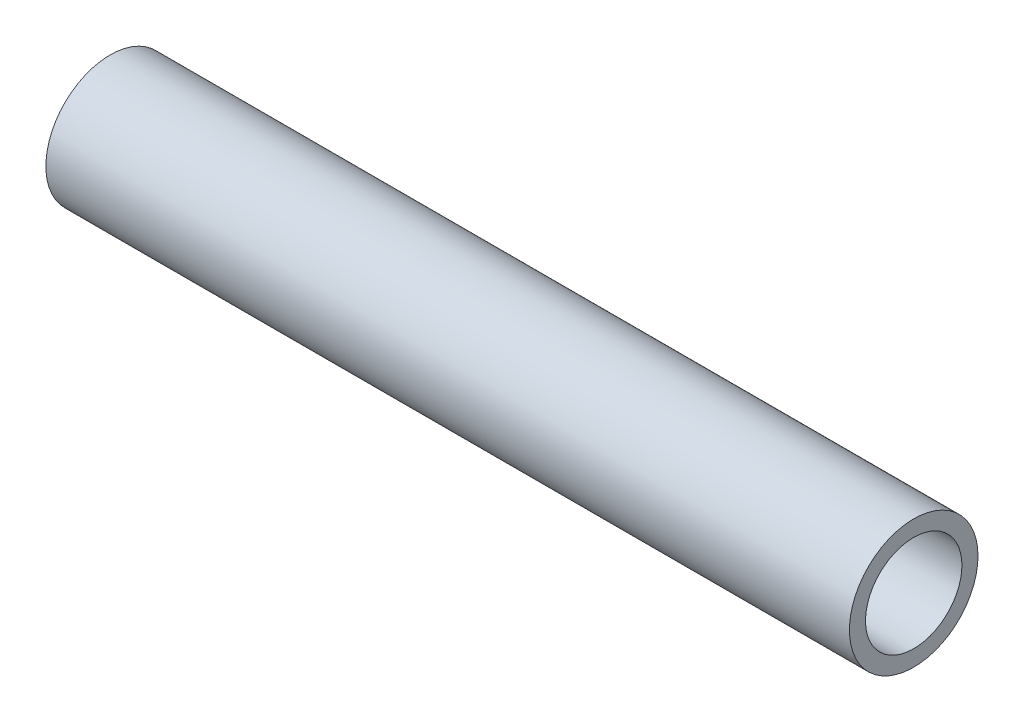
ISO-10303-21;
HEADER;
FILE_DESCRIPTION(('STEP AP214'),'2;1');
FILE_NAME('part.step','',(''),(''),'','','');
FILE_SCHEMA(('AUTOMOTIVE_DESIGN { 1 0 10303 214 1 1 1 1 }'));
ENDSEC;
DATA;
#1=APPLICATION_CONTEXT('core data for automotive mechanical design processes');
#2=APPLICATION_PROTOCOL_DEFINITION('international standard','automotive_design',2000,#1);
#3=PRODUCT_CONTEXT('',#1,'mechanical');
#4=PRODUCT('Part','Part','',(#3));
#5=PRODUCT_RELATED_PRODUCT_CATEGORY('part','',(#4));
#6=PRODUCT_DEFINITION_FORMATION('','',#4);
#7=PRODUCT_DEFINITION_CONTEXT('part definition',#1,'design');
#8=PRODUCT_DEFINITION('design','',#6,#7);
#9=PRODUCT_DEFINITION_SHAPE('','',#8);
#10=(LENGTH_UNIT() NAMED_UNIT(*) SI_UNIT(.MILLI.,.METRE.));
#11=(NAMED_UNIT(*) PLANE_ANGLE_UNIT() SI_UNIT($,.RADIAN.));
#12=(NAMED_UNIT(*) SI_UNIT($,.STERADIAN.) SOLID_ANGLE_UNIT());
#13=UNCERTAINTY_MEASURE_WITH_UNIT(LENGTH_MEASURE(1.E-05),#10,'distance_accuracy_value','');
#14=(GEOMETRIC_REPRESENTATION_CONTEXT(3) GLOBAL_UNCERTAINTY_ASSIGNED_CONTEXT((#13)) GLOBAL_UNIT_ASSIGNED_CONTEXT((#10,
#11,#12)) REPRESENTATION_CONTEXT('',''));
#15=CARTESIAN_POINT('',(0.,0.,0.));
#16=DIRECTION('',(0.,0.,1.));
#17=DIRECTION('',(1.,0.,0.));
#18=AXIS2_PLACEMENT_3D('',#15,#16,#17);
#19=CARTESIAN_POINT('',(25.,0.,0.));
#20=DIRECTION('',(1.,0.,0.));
#21=DIRECTION('',(0.,0.,-1.));
#22=AXIS2_PLACEMENT_3D('',#19,#20,#21);
#23=PLANE('',#22);
#24=CARTESIAN_POINT('',(25.,0.,0.));
#25=DIRECTION('',(1.,0.,0.));
#26=DIRECTION('',(0.,0.,-1.));
#27=AXIS2_PLACEMENT_3D('',#24,#25,#26);
#28=CIRCLE('',#27,2.);
#29=CARTESIAN_POINT('',(25.,0.,-2.));
#30=VERTEX_POINT('',#29);
#31=EDGE_CURVE('E10',#30,#30,#28,.T.);
#32=ORIENTED_EDGE('',*,*,#31,.T.);
#33=EDGE_LOOP('',(#32));
#34=FACE_BOUND('',#33,.T.);
#35=CARTESIAN_POINT('',(25.,0.,0.));
#36=DIRECTION('',(1.,0.,0.));
#37=DIRECTION('',(0.,0.,-1.));
#38=AXIS2_PLACEMENT_3D('',#35,#36,#37);
#39=CIRCLE('',#38,1.5);
#40=CARTESIAN_POINT('',(25.,0.,-1.5));
#41=VERTEX_POINT('',#40);
#42=EDGE_CURVE('E48',#41,#41,#39,.T.);
#43=ORIENTED_EDGE('',*,*,#42,.F.);
#44=EDGE_LOOP('',(#43));
#45=FACE_BOUND('',#44,.T.);
#46=ADVANCED_FACE('F37',(#34,#45),#23,.T.);
#47=CARTESIAN_POINT('',(0.,0.,0.));
#48=DIRECTION('',(1.,0.,0.));
#49=DIRECTION('',(0.,0.,-1.));
#50=AXIS2_PLACEMENT_3D('',#47,#48,#49);
#51=PLANE('',#50);
#52=CARTESIAN_POINT('',(0.,0.,0.));
#53=DIRECTION('',(1.,0.,0.));
#54=DIRECTION('',(0.,0.,-1.));
#55=AXIS2_PLACEMENT_3D('',#52,#53,#54);
#56=CIRCLE('',#55,2.);
#57=CARTESIAN_POINT('',(0.,0.,-2.));
#58=VERTEX_POINT('',#57);
#59=EDGE_CURVE('E41',#58,#58,#56,.T.);
#60=ORIENTED_EDGE('',*,*,#59,.F.);
#61=EDGE_LOOP('',(#60));
#62=FACE_BOUND('',#61,.T.);
#63=CARTESIAN_POINT('',(0.,0.,0.));
#64=DIRECTION('',(1.,0.,0.));
#65=DIRECTION('',(0.,0.,-1.));
#66=AXIS2_PLACEMENT_3D('',#63,#64,#65);
#67=CIRCLE('',#66,1.5);
#68=CARTESIAN_POINT('',(0.,0.,-1.5));
#69=VERTEX_POINT('',#68);
#70=EDGE_CURVE('E50',#69,#69,#67,.T.);
#71=ORIENTED_EDGE('',*,*,#70,.T.);
#72=EDGE_LOOP('',(#71));
#73=FACE_BOUND('',#72,.T.);
#74=ADVANCED_FACE('F60',(#62,#73),#51,.F.);
#75=CARTESIAN_POINT('',(25.,0.,0.));
#76=DIRECTION('',(-1.,0.,0.));
#77=DIRECTION('',(0.,0.,1.));
#78=AXIS2_PLACEMENT_3D('',#75,#76,#77);
#79=CYLINDRICAL_SURFACE('',#78,2.);
#80=ORIENTED_EDGE('',*,*,#31,.F.);
#81=EDGE_LOOP('',(#80));
#82=FACE_BOUND('',#81,.T.);
#83=ORIENTED_EDGE('',*,*,#59,.T.);
#84=EDGE_LOOP('',(#83));
#85=FACE_BOUND('',#84,.T.);
#86=ADVANCED_FACE('F39',(#82,#85),#79,.T.);
#87=CARTESIAN_POINT('',(25.,0.,0.));
#88=DIRECTION('',(-1.,0.,0.));
#89=DIRECTION('',(0.,0.,1.));
#90=AXIS2_PLACEMENT_3D('',#87,#88,#89);
#91=CYLINDRICAL_SURFACE('',#90,1.5);
#92=ORIENTED_EDGE('',*,*,#42,.T.);
#93=EDGE_LOOP('',(#92));
#94=FACE_BOUND('',#93,.T.);
#95=ORIENTED_EDGE('',*,*,#70,.F.);
#96=EDGE_LOOP('',(#95));
#97=FACE_BOUND('',#96,.T.);
#98=ADVANCED_FACE('F56',(#94,#97),#91,.F.);
#99=CLOSED_SHELL('',(#46,#74,#86,#98));
#100=MANIFOLD_SOLID_BREP('B2',#99);
#101=ADVANCED_BREP_SHAPE_REPRESENTATION('',(#18,#100),#14);
#102=SHAPE_DEFINITION_REPRESENTATION(#9,#101);
ENDSEC;
END-ISO-10303-21;
